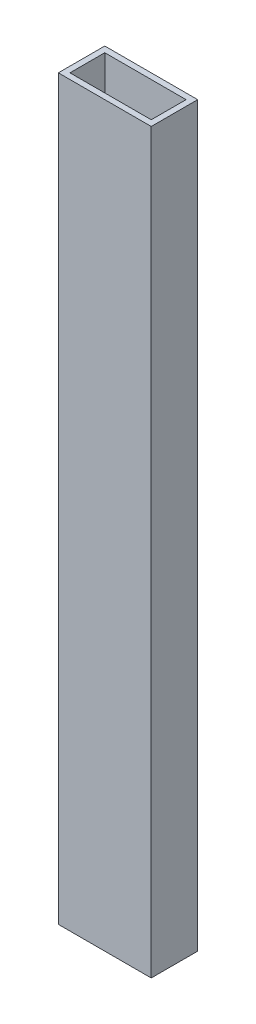
ISO-10303-21;
HEADER;
FILE_DESCRIPTION(('STEP AP214'),'2;1');
FILE_NAME('part.step','',(''),(''),'','','');
FILE_SCHEMA(('AUTOMOTIVE_DESIGN { 1 0 10303 214 1 1 1 1 }'));
ENDSEC;
DATA;
#1=APPLICATION_CONTEXT('core data for automotive mechanical design processes');
#2=APPLICATION_PROTOCOL_DEFINITION('international standard','automotive_design',2000,#1);
#3=PRODUCT_CONTEXT('',#1,'mechanical');
#4=PRODUCT('Part','Part','',(#3));
#5=PRODUCT_RELATED_PRODUCT_CATEGORY('part','',(#4));
#6=PRODUCT_DEFINITION_FORMATION('','',#4);
#7=PRODUCT_DEFINITION_CONTEXT('part definition',#1,'design');
#8=PRODUCT_DEFINITION('design','',#6,#7);
#9=PRODUCT_DEFINITION_SHAPE('','',#8);
#10=(LENGTH_UNIT() NAMED_UNIT(*) SI_UNIT(.MILLI.,.METRE.));
#11=(NAMED_UNIT(*) PLANE_ANGLE_UNIT() SI_UNIT($,.RADIAN.));
#12=(NAMED_UNIT(*) SI_UNIT($,.STERADIAN.) SOLID_ANGLE_UNIT());
#13=UNCERTAINTY_MEASURE_WITH_UNIT(LENGTH_MEASURE(1.E-05),#10,'distance_accuracy_value','');
#14=(GEOMETRIC_REPRESENTATION_CONTEXT(3) GLOBAL_UNCERTAINTY_ASSIGNED_CONTEXT((#13)) GLOBAL_UNIT_ASSIGNED_CONTEXT((#10,
#11,#12)) REPRESENTATION_CONTEXT('',''));
#15=CARTESIAN_POINT('',(0.,0.,0.));
#16=DIRECTION('',(0.,0.,1.));
#17=DIRECTION('',(1.,0.,0.));
#18=AXIS2_PLACEMENT_3D('',#15,#16,#17);
#19=CARTESIAN_POINT('',(0.,403.225,0.));
#20=DIRECTION('',(0.,-1.,0.));
#21=DIRECTION('',(0.,0.,-1.));
#22=AXIS2_PLACEMENT_3D('',#19,#20,#21);
#23=PLANE('',#22);
#24=DIRECTION('',(0.,0.,1.));
#25=VECTOR('',#24,1.);
#26=CARTESIAN_POINT('',(0.,403.225,0.));
#27=LINE('',#26,#25);
#28=CARTESIAN_POINT('',(0.,403.225,-25.4));
#29=VERTEX_POINT('',#28);
#30=CARTESIAN_POINT('',(0.,403.225,0.));
#31=VERTEX_POINT('',#30);
#32=EDGE_CURVE('E134',#29,#31,#27,.T.);
#33=ORIENTED_EDGE('',*,*,#32,.T.);
#34=DIRECTION('',(1.,0.,0.));
#35=VECTOR('',#34,1.);
#36=CARTESIAN_POINT('',(0.,403.225,0.));
#37=LINE('',#36,#35);
#38=CARTESIAN_POINT('',(50.8,403.225,0.));
#39=VERTEX_POINT('',#38);
#40=EDGE_CURVE('E137',#31,#39,#37,.T.);
#41=ORIENTED_EDGE('',*,*,#40,.T.);
#42=DIRECTION('',(0.,0.,-1.));
#43=VECTOR('',#42,1.);
#44=CARTESIAN_POINT('',(50.8,403.225,0.));
#45=LINE('',#44,#43);
#46=CARTESIAN_POINT('',(50.8,403.225,-25.4));
#47=VERTEX_POINT('',#46);
#48=EDGE_CURVE('E140',#39,#47,#45,.T.);
#49=ORIENTED_EDGE('',*,*,#48,.T.);
#50=DIRECTION('',(-1.,0.,0.));
#51=VECTOR('',#50,1.);
#52=CARTESIAN_POINT('',(0.,403.225,-25.4));
#53=LINE('',#52,#51);
#54=EDGE_CURVE('E142',#47,#29,#53,.T.);
#55=ORIENTED_EDGE('',*,*,#54,.T.);
#56=EDGE_LOOP('',(#33,#41,#49,#55));
#57=FACE_BOUND('',#56,.T.);
#58=DIRECTION('',(0.,0.,1.));
#59=VECTOR('',#58,1.);
#60=CARTESIAN_POINT('',(3.175,403.225,-22.225));
#61=LINE('',#60,#59);
#62=CARTESIAN_POINT('',(3.175,403.225,-22.225));
#63=VERTEX_POINT('',#62);
#64=CARTESIAN_POINT('',(3.175,403.225,-3.175));
#65=VERTEX_POINT('',#64);
#66=EDGE_CURVE('E98',#63,#65,#61,.T.);
#67=ORIENTED_EDGE('',*,*,#66,.F.);
#68=DIRECTION('',(-1.,0.,0.));
#69=VECTOR('',#68,1.);
#70=CARTESIAN_POINT('',(3.175,403.225,-22.225));
#71=LINE('',#70,#69);
#72=CARTESIAN_POINT('',(47.625,403.225,-22.225));
#73=VERTEX_POINT('',#72);
#74=EDGE_CURVE('E120',#73,#63,#71,.T.);
#75=ORIENTED_EDGE('',*,*,#74,.F.);
#76=DIRECTION('',(0.,0.,-1.));
#77=VECTOR('',#76,1.);
#78=CARTESIAN_POINT('',(47.625,403.225,-22.225));
#79=LINE('',#78,#77);
#80=CARTESIAN_POINT('',(47.625,403.225,-3.175));
#81=VERTEX_POINT('',#80);
#82=EDGE_CURVE('E118',#81,#73,#79,.T.);
#83=ORIENTED_EDGE('',*,*,#82,.F.);
#84=DIRECTION('',(1.,0.,0.));
#85=VECTOR('',#84,1.);
#86=CARTESIAN_POINT('',(3.175,403.225,-3.175));
#87=LINE('',#86,#85);
#88=EDGE_CURVE('E106',#65,#81,#87,.T.);
#89=ORIENTED_EDGE('',*,*,#88,.F.);
#90=EDGE_LOOP('',(#67,#75,#83,#89));
#91=FACE_BOUND('',#90,.T.);
#92=ADVANCED_FACE('F33',(#57,#91),#23,.F.);
#93=CARTESIAN_POINT('',(0.,0.,0.));
#94=DIRECTION('',(0.,-1.,0.));
#95=DIRECTION('',(0.,0.,-1.));
#96=AXIS2_PLACEMENT_3D('',#93,#94,#95);
#97=PLANE('',#96);
#98=DIRECTION('',(0.,0.,1.));
#99=VECTOR('',#98,1.);
#100=CARTESIAN_POINT('',(0.,0.,0.));
#101=LINE('',#100,#99);
#102=CARTESIAN_POINT('',(0.,0.,-25.4));
#103=VERTEX_POINT('',#102);
#104=CARTESIAN_POINT('',(0.,0.,0.));
#105=VERTEX_POINT('',#104);
#106=EDGE_CURVE('E114',#103,#105,#101,.T.);
#107=ORIENTED_EDGE('',*,*,#106,.F.);
#108=DIRECTION('',(-1.,0.,0.));
#109=VECTOR('',#108,1.);
#110=CARTESIAN_POINT('',(0.,0.,-25.4));
#111=LINE('',#110,#109);
#112=CARTESIAN_POINT('',(50.8,0.,-25.4));
#113=VERTEX_POINT('',#112);
#114=EDGE_CURVE('E138',#113,#103,#111,.T.);
#115=ORIENTED_EDGE('',*,*,#114,.F.);
#116=DIRECTION('',(0.,0.,-1.));
#117=VECTOR('',#116,1.);
#118=CARTESIAN_POINT('',(50.8,0.,0.));
#119=LINE('',#118,#117);
#120=CARTESIAN_POINT('',(50.8,0.,0.));
#121=VERTEX_POINT('',#120);
#122=EDGE_CURVE('E149',#121,#113,#119,.T.);
#123=ORIENTED_EDGE('',*,*,#122,.F.);
#124=DIRECTION('',(1.,0.,0.));
#125=VECTOR('',#124,1.);
#126=CARTESIAN_POINT('',(0.,0.,0.));
#127=LINE('',#126,#125);
#128=EDGE_CURVE('E147',#105,#121,#127,.T.);
#129=ORIENTED_EDGE('',*,*,#128,.F.);
#130=EDGE_LOOP('',(#107,#115,#123,#129));
#131=FACE_BOUND('',#130,.T.);
#132=DIRECTION('',(-1.,0.,0.));
#133=VECTOR('',#132,1.);
#134=CARTESIAN_POINT('',(3.175,0.,-22.225));
#135=LINE('',#134,#133);
#136=CARTESIAN_POINT('',(47.625,0.,-22.225));
#137=VERTEX_POINT('',#136);
#138=CARTESIAN_POINT('',(3.175,0.,-22.225));
#139=VERTEX_POINT('',#138);
#140=EDGE_CURVE('E107',#137,#139,#135,.T.);
#141=ORIENTED_EDGE('',*,*,#140,.T.);
#142=DIRECTION('',(0.,0.,1.));
#143=VECTOR('',#142,1.);
#144=CARTESIAN_POINT('',(3.175,0.,-22.225));
#145=LINE('',#144,#143);
#146=CARTESIAN_POINT('',(3.175,0.,-3.175));
#147=VERTEX_POINT('',#146);
#148=EDGE_CURVE('E56',#139,#147,#145,.T.);
#149=ORIENTED_EDGE('',*,*,#148,.T.);
#150=DIRECTION('',(1.,0.,0.));
#151=VECTOR('',#150,1.);
#152=CARTESIAN_POINT('',(3.175,0.,-3.175));
#153=LINE('',#152,#151);
#154=CARTESIAN_POINT('',(47.625,0.,-3.175));
#155=VERTEX_POINT('',#154);
#156=EDGE_CURVE('E113',#147,#155,#153,.T.);
#157=ORIENTED_EDGE('',*,*,#156,.T.);
#158=DIRECTION('',(0.,0.,-1.));
#159=VECTOR('',#158,1.);
#160=CARTESIAN_POINT('',(47.625,0.,-22.225));
#161=LINE('',#160,#159);
#162=EDGE_CURVE('E126',#155,#137,#161,.T.);
#163=ORIENTED_EDGE('',*,*,#162,.T.);
#164=EDGE_LOOP('',(#141,#149,#157,#163));
#165=FACE_BOUND('',#164,.T.);
#166=ADVANCED_FACE('F167',(#131,#165),#97,.T.);
#167=CARTESIAN_POINT('',(0.,403.225,0.));
#168=DIRECTION('',(1.,0.,0.));
#169=DIRECTION('',(0.,0.,-1.));
#170=AXIS2_PLACEMENT_3D('',#167,#168,#169);
#171=PLANE('',#170);
#172=ORIENTED_EDGE('',*,*,#106,.T.);
#173=DIRECTION('',(0.,-1.,0.));
#174=VECTOR('',#173,1.);
#175=CARTESIAN_POINT('',(0.,403.225,0.));
#176=LINE('',#175,#174);
#177=EDGE_CURVE('E11',#31,#105,#176,.T.);
#178=ORIENTED_EDGE('',*,*,#177,.F.);
#179=ORIENTED_EDGE('',*,*,#32,.F.);
#180=DIRECTION('',(0.,-1.,0.));
#181=VECTOR('',#180,1.);
#182=CARTESIAN_POINT('',(0.,403.225,-25.4));
#183=LINE('',#182,#181);
#184=EDGE_CURVE('E144',#29,#103,#183,.T.);
#185=ORIENTED_EDGE('',*,*,#184,.T.);
#186=EDGE_LOOP('',(#172,#178,#179,#185));
#187=FACE_BOUND('',#186,.T.);
#188=ADVANCED_FACE('F35',(#187),#171,.F.);
#189=CARTESIAN_POINT('',(0.,403.225,0.));
#190=DIRECTION('',(0.,0.,-1.));
#191=DIRECTION('',(-1.,0.,0.));
#192=AXIS2_PLACEMENT_3D('',#189,#190,#191);
#193=PLANE('',#192);
#194=ORIENTED_EDGE('',*,*,#128,.T.);
#195=DIRECTION('',(0.,-1.,0.));
#196=VECTOR('',#195,1.);
#197=CARTESIAN_POINT('',(50.8,403.225,0.));
#198=LINE('',#197,#196);
#199=EDGE_CURVE('E41',#39,#121,#198,.T.);
#200=ORIENTED_EDGE('',*,*,#199,.F.);
#201=ORIENTED_EDGE('',*,*,#40,.F.);
#202=ORIENTED_EDGE('',*,*,#177,.T.);
#203=EDGE_LOOP('',(#194,#200,#201,#202));
#204=FACE_BOUND('',#203,.T.);
#205=ADVANCED_FACE('F177',(#204),#193,.F.);
#206=CARTESIAN_POINT('',(50.8,403.225,0.));
#207=DIRECTION('',(-1.,0.,0.));
#208=DIRECTION('',(0.,0.,1.));
#209=AXIS2_PLACEMENT_3D('',#206,#207,#208);
#210=PLANE('',#209);
#211=ORIENTED_EDGE('',*,*,#122,.T.);
#212=DIRECTION('',(0.,-1.,0.));
#213=VECTOR('',#212,1.);
#214=CARTESIAN_POINT('',(50.8,403.225,-25.4));
#215=LINE('',#214,#213);
#216=EDGE_CURVE('E154',#47,#113,#215,.T.);
#217=ORIENTED_EDGE('',*,*,#216,.F.);
#218=ORIENTED_EDGE('',*,*,#48,.F.);
#219=ORIENTED_EDGE('',*,*,#199,.T.);
#220=EDGE_LOOP('',(#211,#217,#218,#219));
#221=FACE_BOUND('',#220,.T.);
#222=ADVANCED_FACE('F161',(#221),#210,.F.);
#223=CARTESIAN_POINT('',(0.,403.225,-25.4));
#224=DIRECTION('',(0.,0.,1.));
#225=DIRECTION('',(1.,0.,0.));
#226=AXIS2_PLACEMENT_3D('',#223,#224,#225);
#227=PLANE('',#226);
#228=ORIENTED_EDGE('',*,*,#114,.T.);
#229=ORIENTED_EDGE('',*,*,#184,.F.);
#230=ORIENTED_EDGE('',*,*,#54,.F.);
#231=ORIENTED_EDGE('',*,*,#216,.T.);
#232=EDGE_LOOP('',(#228,#229,#230,#231));
#233=FACE_BOUND('',#232,.T.);
#234=ADVANCED_FACE('F171',(#233),#227,.F.);
#235=CARTESIAN_POINT('',(3.175,403.225,-22.225));
#236=DIRECTION('',(1.,0.,0.));
#237=DIRECTION('',(0.,0.,-1.));
#238=AXIS2_PLACEMENT_3D('',#235,#236,#237);
#239=PLANE('',#238);
#240=ORIENTED_EDGE('',*,*,#148,.F.);
#241=DIRECTION('',(0.,-1.,0.));
#242=VECTOR('',#241,1.);
#243=CARTESIAN_POINT('',(3.175,403.225,-22.225));
#244=LINE('',#243,#242);
#245=EDGE_CURVE('E102',#63,#139,#244,.T.);
#246=ORIENTED_EDGE('',*,*,#245,.F.);
#247=ORIENTED_EDGE('',*,*,#66,.T.);
#248=DIRECTION('',(0.,-1.,0.));
#249=VECTOR('',#248,1.);
#250=CARTESIAN_POINT('',(3.175,403.225,-3.175));
#251=LINE('',#250,#249);
#252=EDGE_CURVE('E101',#65,#147,#251,.T.);
#253=ORIENTED_EDGE('',*,*,#252,.T.);
#254=EDGE_LOOP('',(#240,#246,#247,#253));
#255=FACE_BOUND('',#254,.T.);
#256=ADVANCED_FACE('F100',(#255),#239,.T.);
#257=CARTESIAN_POINT('',(3.175,403.225,-3.175));
#258=DIRECTION('',(0.,0.,-1.));
#259=DIRECTION('',(-1.,0.,0.));
#260=AXIS2_PLACEMENT_3D('',#257,#258,#259);
#261=PLANE('',#260);
#262=ORIENTED_EDGE('',*,*,#156,.F.);
#263=ORIENTED_EDGE('',*,*,#252,.F.);
#264=ORIENTED_EDGE('',*,*,#88,.T.);
#265=DIRECTION('',(0.,-1.,0.));
#266=VECTOR('',#265,1.);
#267=CARTESIAN_POINT('',(47.625,403.225,-3.175));
#268=LINE('',#267,#266);
#269=EDGE_CURVE('E115',#81,#155,#268,.T.);
#270=ORIENTED_EDGE('',*,*,#269,.T.);
#271=EDGE_LOOP('',(#262,#263,#264,#270));
#272=FACE_BOUND('',#271,.T.);
#273=ADVANCED_FACE('F110',(#272),#261,.T.);
#274=CARTESIAN_POINT('',(47.625,403.225,-22.225));
#275=DIRECTION('',(-1.,0.,0.));
#276=DIRECTION('',(0.,0.,1.));
#277=AXIS2_PLACEMENT_3D('',#274,#275,#276);
#278=PLANE('',#277);
#279=ORIENTED_EDGE('',*,*,#162,.F.);
#280=ORIENTED_EDGE('',*,*,#269,.F.);
#281=ORIENTED_EDGE('',*,*,#82,.T.);
#282=DIRECTION('',(0.,-1.,0.));
#283=VECTOR('',#282,1.);
#284=CARTESIAN_POINT('',(47.625,403.225,-22.225));
#285=LINE('',#284,#283);
#286=EDGE_CURVE('E48',#73,#137,#285,.T.);
#287=ORIENTED_EDGE('',*,*,#286,.T.);
#288=EDGE_LOOP('',(#279,#280,#281,#287));
#289=FACE_BOUND('',#288,.T.);
#290=ADVANCED_FACE('F200',(#289),#278,.T.);
#291=CARTESIAN_POINT('',(3.175,403.225,-22.225));
#292=DIRECTION('',(0.,0.,1.));
#293=DIRECTION('',(1.,0.,0.));
#294=AXIS2_PLACEMENT_3D('',#291,#292,#293);
#295=PLANE('',#294);
#296=ORIENTED_EDGE('',*,*,#140,.F.);
#297=ORIENTED_EDGE('',*,*,#286,.F.);
#298=ORIENTED_EDGE('',*,*,#74,.T.);
#299=ORIENTED_EDGE('',*,*,#245,.T.);
#300=EDGE_LOOP('',(#296,#297,#298,#299));
#301=FACE_BOUND('',#300,.T.);
#302=ADVANCED_FACE('F204',(#301),#295,.T.);
#303=CLOSED_SHELL('',(#92,#166,#188,#205,#222,#234,#256,#273,#290,#302));
#304=MANIFOLD_SOLID_BREP('B2',#303);
#305=ADVANCED_BREP_SHAPE_REPRESENTATION('',(#18,#304),#14);
#306=SHAPE_DEFINITION_REPRESENTATION(#9,#305);
ENDSEC;
END-ISO-10303-21;
